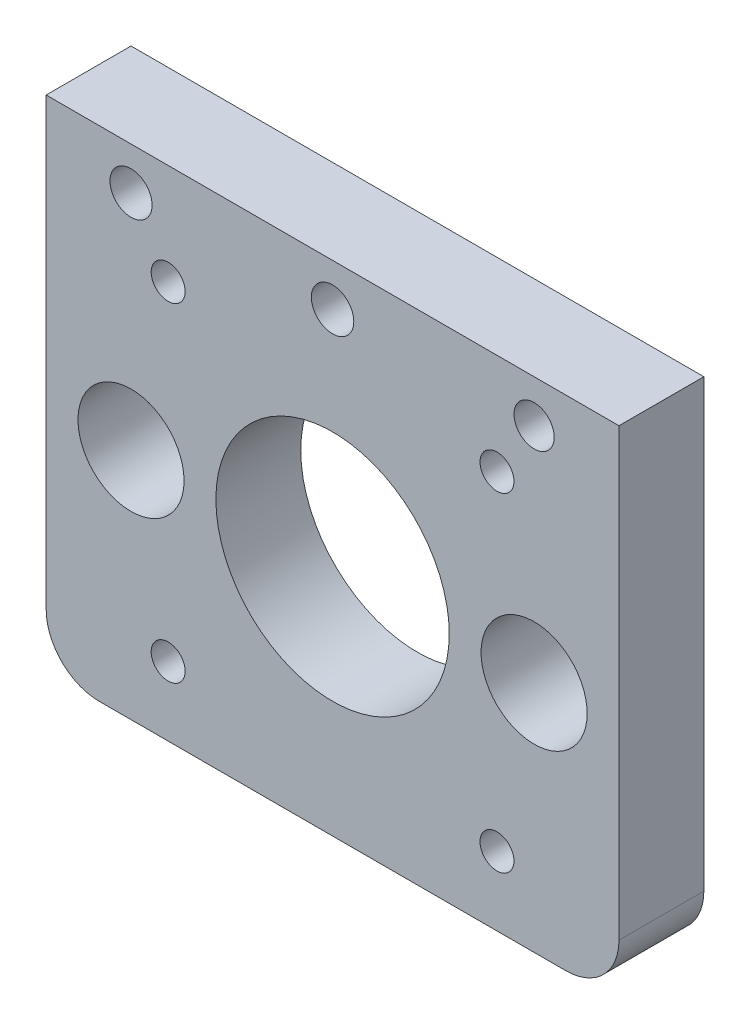
ISO-10303-21;
HEADER;
FILE_DESCRIPTION(('STEP AP214'),'2;1');
FILE_NAME('part.step','',(''),(''),'','','');
FILE_SCHEMA(('AUTOMOTIVE_DESIGN { 1 0 10303 214 1 1 1 1 }'));
ENDSEC;
DATA;
#1=APPLICATION_CONTEXT('core data for automotive mechanical design processes');
#2=APPLICATION_PROTOCOL_DEFINITION('international standard','automotive_design',2000,#1);
#3=PRODUCT_CONTEXT('',#1,'mechanical');
#4=PRODUCT('Part','Part','',(#3));
#5=PRODUCT_RELATED_PRODUCT_CATEGORY('part','',(#4));
#6=PRODUCT_DEFINITION_FORMATION('','',#4);
#7=PRODUCT_DEFINITION_CONTEXT('part definition',#1,'design');
#8=PRODUCT_DEFINITION('design','',#6,#7);
#9=PRODUCT_DEFINITION_SHAPE('','',#8);
#10=(LENGTH_UNIT() NAMED_UNIT(*) SI_UNIT(.MILLI.,.METRE.));
#11=(NAMED_UNIT(*) PLANE_ANGLE_UNIT() SI_UNIT($,.RADIAN.));
#12=(NAMED_UNIT(*) SI_UNIT($,.STERADIAN.) SOLID_ANGLE_UNIT());
#13=UNCERTAINTY_MEASURE_WITH_UNIT(LENGTH_MEASURE(1.E-05),#10,'distance_accuracy_value','');
#14=(GEOMETRIC_REPRESENTATION_CONTEXT(3) GLOBAL_UNCERTAINTY_ASSIGNED_CONTEXT((#13)) GLOBAL_UNIT_ASSIGNED_CONTEXT((#10,
#11,#12)) REPRESENTATION_CONTEXT('',''));
#15=CARTESIAN_POINT('',(0.,0.,0.));
#16=DIRECTION('',(0.,0.,1.));
#17=DIRECTION('',(1.,0.,0.));
#18=AXIS2_PLACEMENT_3D('',#15,#16,#17);
#19=CARTESIAN_POINT('',(-22.,-17.,8.));
#20=DIRECTION('',(0.,0.,-1.));
#21=DIRECTION('',(-1.,0.,0.));
#22=AXIS2_PLACEMENT_3D('',#19,#20,#21);
#23=PLANE('',#22);
#24=CARTESIAN_POINT('',(15.5,-15.5,8.));
#25=DIRECTION('',(0.,0.,1.));
#26=DIRECTION('',(1.,0.,0.));
#27=AXIS2_PLACEMENT_3D('',#24,#25,#26);
#28=CIRCLE('',#27,1.6);
#29=CARTESIAN_POINT('',(17.1,-15.5,8.));
#30=VERTEX_POINT('',#29);
#31=EDGE_CURVE('E213',#30,#30,#28,.T.);
#32=ORIENTED_EDGE('',*,*,#31,.F.);
#33=EDGE_LOOP('',(#32));
#34=FACE_BOUND('',#33,.T.);
#35=CARTESIAN_POINT('',(-15.5,15.5,8.));
#36=DIRECTION('',(0.,0.,1.));
#37=DIRECTION('',(1.,0.,0.));
#38=AXIS2_PLACEMENT_3D('',#35,#36,#37);
#39=CIRCLE('',#38,1.6);
#40=CARTESIAN_POINT('',(-13.9,15.5,8.));
#41=VERTEX_POINT('',#40);
#42=EDGE_CURVE('E225',#41,#41,#39,.T.);
#43=ORIENTED_EDGE('',*,*,#42,.F.);
#44=EDGE_LOOP('',(#43));
#45=FACE_BOUND('',#44,.T.);
#46=CARTESIAN_POINT('',(-19.,21.,8.));
#47=DIRECTION('',(0.,0.,1.));
#48=DIRECTION('',(1.,0.,0.));
#49=AXIS2_PLACEMENT_3D('',#46,#47,#48);
#50=CIRCLE('',#49,1.98463309671091);
#51=CARTESIAN_POINT('',(-17.0153669032891,21.,8.));
#52=VERTEX_POINT('',#51);
#53=EDGE_CURVE('E237',#52,#52,#50,.T.);
#54=ORIENTED_EDGE('',*,*,#53,.F.);
#55=EDGE_LOOP('',(#54));
#56=FACE_BOUND('',#55,.T.);
#57=CARTESIAN_POINT('',(0.,0.,8.));
#58=DIRECTION('',(0.,0.,1.));
#59=DIRECTION('',(1.,0.,0.));
#60=AXIS2_PLACEMENT_3D('',#57,#58,#59);
#61=CIRCLE('',#60,11.);
#62=CARTESIAN_POINT('',(11.,0.,8.));
#63=VERTEX_POINT('',#62);
#64=EDGE_CURVE('E249',#63,#63,#61,.T.);
#65=ORIENTED_EDGE('',*,*,#64,.F.);
#66=EDGE_LOOP('',(#65));
#67=FACE_BOUND('',#66,.T.);
#68=CARTESIAN_POINT('',(-19.,0.,8.));
#69=DIRECTION('',(0.,0.,1.));
#70=DIRECTION('',(1.,0.,0.));
#71=AXIS2_PLACEMENT_3D('',#68,#69,#70);
#72=CIRCLE('',#71,5.);
#73=CARTESIAN_POINT('',(-14.,0.,8.));
#74=VERTEX_POINT('',#73);
#75=EDGE_CURVE('E121',#74,#74,#72,.T.);
#76=ORIENTED_EDGE('',*,*,#75,.F.);
#77=EDGE_LOOP('',(#76));
#78=FACE_BOUND('',#77,.T.);
#79=DIRECTION('',(0.,1.,0.));
#80=VECTOR('',#79,1.);
#81=CARTESIAN_POINT('',(27.,-17.,8.));
#82=LINE('',#81,#80);
#83=CARTESIAN_POINT('',(27.,-17.,8.));
#84=VERTEX_POINT('',#83);
#85=CARTESIAN_POINT('',(27.,25.,8.));
#86=VERTEX_POINT('',#85);
#87=EDGE_CURVE('E128',#84,#86,#82,.T.);
#88=ORIENTED_EDGE('',*,*,#87,.T.);
#89=DIRECTION('',(-1.,0.,0.));
#90=VECTOR('',#89,1.);
#91=CARTESIAN_POINT('',(-27.,25.,8.));
#92=LINE('',#91,#90);
#93=CARTESIAN_POINT('',(-27.,25.,8.));
#94=VERTEX_POINT('',#93);
#95=EDGE_CURVE('E86',#86,#94,#92,.T.);
#96=ORIENTED_EDGE('',*,*,#95,.T.);
#97=DIRECTION('',(0.,-1.,0.));
#98=VECTOR('',#97,1.);
#99=CARTESIAN_POINT('',(-27.,-17.,8.));
#100=LINE('',#99,#98);
#101=CARTESIAN_POINT('',(-27.,-17.,8.));
#102=VERTEX_POINT('',#101);
#103=EDGE_CURVE('E99',#94,#102,#100,.T.);
#104=ORIENTED_EDGE('',*,*,#103,.T.);
#105=CARTESIAN_POINT('',(-22.,-17.,8.));
#106=DIRECTION('',(0.,0.,1.));
#107=DIRECTION('',(-1.,0.,0.));
#108=AXIS2_PLACEMENT_3D('',#105,#106,#107);
#109=CIRCLE('',#108,5.);
#110=CARTESIAN_POINT('',(-22.,-22.,8.));
#111=VERTEX_POINT('',#110);
#112=EDGE_CURVE('E93',#102,#111,#109,.T.);
#113=ORIENTED_EDGE('',*,*,#112,.T.);
#114=DIRECTION('',(1.,0.,0.));
#115=VECTOR('',#114,1.);
#116=CARTESIAN_POINT('',(-22.,-22.,8.));
#117=LINE('',#116,#115);
#118=CARTESIAN_POINT('',(22.,-22.,8.));
#119=VERTEX_POINT('',#118);
#120=EDGE_CURVE('E97',#111,#119,#117,.T.);
#121=ORIENTED_EDGE('',*,*,#120,.T.);
#122=CARTESIAN_POINT('',(22.,-17.,8.));
#123=DIRECTION('',(0.,0.,1.));
#124=DIRECTION('',(-1.,0.,0.));
#125=AXIS2_PLACEMENT_3D('',#122,#123,#124);
#126=CIRCLE('',#125,5.);
#127=EDGE_CURVE('E49',#119,#84,#126,.T.);
#128=ORIENTED_EDGE('',*,*,#127,.T.);
#129=EDGE_LOOP('',(#88,#96,#104,#113,#121,#128));
#130=FACE_BOUND('',#129,.T.);
#131=CARTESIAN_POINT('',(19.,0.,8.));
#132=DIRECTION('',(0.,0.,1.));
#133=DIRECTION('',(1.,0.,0.));
#134=AXIS2_PLACEMENT_3D('',#131,#132,#133);
#135=CIRCLE('',#134,5.);
#136=CARTESIAN_POINT('',(24.,0.,8.));
#137=VERTEX_POINT('',#136);
#138=EDGE_CURVE('E255',#137,#137,#135,.T.);
#139=ORIENTED_EDGE('',*,*,#138,.F.);
#140=EDGE_LOOP('',(#139));
#141=FACE_BOUND('',#140,.T.);
#142=CARTESIAN_POINT('',(0.,21.,8.));
#143=DIRECTION('',(0.,0.,1.));
#144=DIRECTION('',(1.,0.,0.));
#145=AXIS2_PLACEMENT_3D('',#142,#143,#144);
#146=CIRCLE('',#145,2.);
#147=CARTESIAN_POINT('',(2.,21.,8.));
#148=VERTEX_POINT('',#147);
#149=EDGE_CURVE('E243',#148,#148,#146,.T.);
#150=ORIENTED_EDGE('',*,*,#149,.F.);
#151=EDGE_LOOP('',(#150));
#152=FACE_BOUND('',#151,.T.);
#153=CARTESIAN_POINT('',(19.,21.,8.));
#154=DIRECTION('',(0.,0.,1.));
#155=DIRECTION('',(1.,0.,0.));
#156=AXIS2_PLACEMENT_3D('',#153,#154,#155);
#157=CIRCLE('',#156,1.89435690287992);
#158=CARTESIAN_POINT('',(20.8943569028799,21.,8.));
#159=VERTEX_POINT('',#158);
#160=EDGE_CURVE('E231',#159,#159,#157,.T.);
#161=ORIENTED_EDGE('',*,*,#160,.F.);
#162=EDGE_LOOP('',(#161));
#163=FACE_BOUND('',#162,.T.);
#164=CARTESIAN_POINT('',(15.5,15.5,8.));
#165=DIRECTION('',(0.,0.,1.));
#166=DIRECTION('',(1.,0.,0.));
#167=AXIS2_PLACEMENT_3D('',#164,#165,#166);
#168=CIRCLE('',#167,1.6);
#169=CARTESIAN_POINT('',(17.1,15.5,8.));
#170=VERTEX_POINT('',#169);
#171=EDGE_CURVE('E219',#170,#170,#168,.T.);
#172=ORIENTED_EDGE('',*,*,#171,.F.);
#173=EDGE_LOOP('',(#172));
#174=FACE_BOUND('',#173,.T.);
#175=CARTESIAN_POINT('',(-15.5,-15.5,8.));
#176=DIRECTION('',(0.,0.,1.));
#177=DIRECTION('',(1.,0.,0.));
#178=AXIS2_PLACEMENT_3D('',#175,#176,#177);
#179=CIRCLE('',#178,1.6);
#180=CARTESIAN_POINT('',(-13.9,-15.5,8.));
#181=VERTEX_POINT('',#180);
#182=EDGE_CURVE('E204',#181,#181,#179,.T.);
#183=ORIENTED_EDGE('',*,*,#182,.F.);
#184=EDGE_LOOP('',(#183));
#185=FACE_BOUND('',#184,.T.);
#186=ADVANCED_FACE('F32',(#34,#45,#56,#67,#78,#130,#141,#152,#163,#174,#185),#23,.F.);
#187=CARTESIAN_POINT('',(-22.,-17.,0.));
#188=DIRECTION('',(0.,0.,-1.));
#189=DIRECTION('',(-1.,0.,0.));
#190=AXIS2_PLACEMENT_3D('',#187,#188,#189);
#191=PLANE('',#190);
#192=CARTESIAN_POINT('',(15.5,-15.5,0.));
#193=DIRECTION('',(0.,0.,1.));
#194=DIRECTION('',(1.,0.,0.));
#195=AXIS2_PLACEMENT_3D('',#192,#193,#194);
#196=CIRCLE('',#195,1.6);
#197=CARTESIAN_POINT('',(17.1,-15.5,0.));
#198=VERTEX_POINT('',#197);
#199=EDGE_CURVE('E210',#198,#198,#196,.T.);
#200=ORIENTED_EDGE('',*,*,#199,.T.);
#201=EDGE_LOOP('',(#200));
#202=FACE_BOUND('',#201,.T.);
#203=CARTESIAN_POINT('',(-15.5,15.5,0.));
#204=DIRECTION('',(0.,0.,1.));
#205=DIRECTION('',(1.,0.,0.));
#206=AXIS2_PLACEMENT_3D('',#203,#204,#205);
#207=CIRCLE('',#206,1.6);
#208=CARTESIAN_POINT('',(-13.9,15.5,0.));
#209=VERTEX_POINT('',#208);
#210=EDGE_CURVE('E222',#209,#209,#207,.T.);
#211=ORIENTED_EDGE('',*,*,#210,.T.);
#212=EDGE_LOOP('',(#211));
#213=FACE_BOUND('',#212,.T.);
#214=CARTESIAN_POINT('',(-19.,21.,0.));
#215=DIRECTION('',(0.,0.,1.));
#216=DIRECTION('',(1.,0.,0.));
#217=AXIS2_PLACEMENT_3D('',#214,#215,#216);
#218=CIRCLE('',#217,1.98463309671091);
#219=CARTESIAN_POINT('',(-17.0153669032891,21.,0.));
#220=VERTEX_POINT('',#219);
#221=EDGE_CURVE('E234',#220,#220,#218,.T.);
#222=ORIENTED_EDGE('',*,*,#221,.T.);
#223=EDGE_LOOP('',(#222));
#224=FACE_BOUND('',#223,.T.);
#225=CARTESIAN_POINT('',(0.,0.,0.));
#226=DIRECTION('',(0.,0.,1.));
#227=DIRECTION('',(1.,0.,0.));
#228=AXIS2_PLACEMENT_3D('',#225,#226,#227);
#229=CIRCLE('',#228,11.);
#230=CARTESIAN_POINT('',(11.,0.,0.));
#231=VERTEX_POINT('',#230);
#232=EDGE_CURVE('E246',#231,#231,#229,.T.);
#233=ORIENTED_EDGE('',*,*,#232,.T.);
#234=EDGE_LOOP('',(#233));
#235=FACE_BOUND('',#234,.T.);
#236=CARTESIAN_POINT('',(-19.,0.,0.));
#237=DIRECTION('',(0.,0.,1.));
#238=DIRECTION('',(1.,0.,0.));
#239=AXIS2_PLACEMENT_3D('',#236,#237,#238);
#240=CIRCLE('',#239,5.);
#241=CARTESIAN_POINT('',(-14.,0.,0.));
#242=VERTEX_POINT('',#241);
#243=EDGE_CURVE('E258',#242,#242,#240,.T.);
#244=ORIENTED_EDGE('',*,*,#243,.T.);
#245=EDGE_LOOP('',(#244));
#246=FACE_BOUND('',#245,.T.);
#247=DIRECTION('',(0.,1.,0.));
#248=VECTOR('',#247,1.);
#249=CARTESIAN_POINT('',(27.,-17.,0.));
#250=LINE('',#249,#248);
#251=CARTESIAN_POINT('',(27.,-17.,0.));
#252=VERTEX_POINT('',#251);
#253=CARTESIAN_POINT('',(27.,25.,0.));
#254=VERTEX_POINT('',#253);
#255=EDGE_CURVE('E117',#252,#254,#250,.T.);
#256=ORIENTED_EDGE('',*,*,#255,.F.);
#257=CARTESIAN_POINT('',(22.,-17.,0.));
#258=DIRECTION('',(0.,0.,1.));
#259=DIRECTION('',(-1.,0.,0.));
#260=AXIS2_PLACEMENT_3D('',#257,#258,#259);
#261=CIRCLE('',#260,5.);
#262=CARTESIAN_POINT('',(22.,-22.,0.));
#263=VERTEX_POINT('',#262);
#264=EDGE_CURVE('E78',#263,#252,#261,.T.);
#265=ORIENTED_EDGE('',*,*,#264,.F.);
#266=DIRECTION('',(1.,0.,0.));
#267=VECTOR('',#266,1.);
#268=CARTESIAN_POINT('',(-22.,-22.,0.));
#269=LINE('',#268,#267);
#270=CARTESIAN_POINT('',(-22.,-22.,0.));
#271=VERTEX_POINT('',#270);
#272=EDGE_CURVE('E72',#271,#263,#269,.T.);
#273=ORIENTED_EDGE('',*,*,#272,.F.);
#274=CARTESIAN_POINT('',(-22.,-17.,0.));
#275=DIRECTION('',(0.,0.,1.));
#276=DIRECTION('',(-1.,0.,0.));
#277=AXIS2_PLACEMENT_3D('',#274,#275,#276);
#278=CIRCLE('',#277,5.);
#279=CARTESIAN_POINT('',(-27.,-17.,0.));
#280=VERTEX_POINT('',#279);
#281=EDGE_CURVE('E107',#280,#271,#278,.T.);
#282=ORIENTED_EDGE('',*,*,#281,.F.);
#283=DIRECTION('',(0.,-1.,0.));
#284=VECTOR('',#283,1.);
#285=CARTESIAN_POINT('',(-27.,-17.,0.));
#286=LINE('',#285,#284);
#287=CARTESIAN_POINT('',(-27.,25.,0.));
#288=VERTEX_POINT('',#287);
#289=EDGE_CURVE('E123',#288,#280,#286,.T.);
#290=ORIENTED_EDGE('',*,*,#289,.F.);
#291=DIRECTION('',(-1.,0.,0.));
#292=VECTOR('',#291,1.);
#293=CARTESIAN_POINT('',(-27.,25.,0.));
#294=LINE('',#293,#292);
#295=EDGE_CURVE('E120',#254,#288,#294,.T.);
#296=ORIENTED_EDGE('',*,*,#295,.F.);
#297=EDGE_LOOP('',(#256,#265,#273,#282,#290,#296));
#298=FACE_BOUND('',#297,.T.);
#299=CARTESIAN_POINT('',(19.,0.,0.));
#300=DIRECTION('',(0.,0.,1.));
#301=DIRECTION('',(1.,0.,0.));
#302=AXIS2_PLACEMENT_3D('',#299,#300,#301);
#303=CIRCLE('',#302,5.);
#304=CARTESIAN_POINT('',(24.,0.,0.));
#305=VERTEX_POINT('',#304);
#306=EDGE_CURVE('E252',#305,#305,#303,.T.);
#307=ORIENTED_EDGE('',*,*,#306,.T.);
#308=EDGE_LOOP('',(#307));
#309=FACE_BOUND('',#308,.T.);
#310=CARTESIAN_POINT('',(0.,21.,0.));
#311=DIRECTION('',(0.,0.,1.));
#312=DIRECTION('',(1.,0.,0.));
#313=AXIS2_PLACEMENT_3D('',#310,#311,#312);
#314=CIRCLE('',#313,2.);
#315=CARTESIAN_POINT('',(2.,21.,0.));
#316=VERTEX_POINT('',#315);
#317=EDGE_CURVE('E240',#316,#316,#314,.T.);
#318=ORIENTED_EDGE('',*,*,#317,.T.);
#319=EDGE_LOOP('',(#318));
#320=FACE_BOUND('',#319,.T.);
#321=CARTESIAN_POINT('',(19.,21.,0.));
#322=DIRECTION('',(0.,0.,1.));
#323=DIRECTION('',(1.,0.,0.));
#324=AXIS2_PLACEMENT_3D('',#321,#322,#323);
#325=CIRCLE('',#324,1.89435690287992);
#326=CARTESIAN_POINT('',(20.8943569028799,21.,0.));
#327=VERTEX_POINT('',#326);
#328=EDGE_CURVE('E228',#327,#327,#325,.T.);
#329=ORIENTED_EDGE('',*,*,#328,.T.);
#330=EDGE_LOOP('',(#329));
#331=FACE_BOUND('',#330,.T.);
#332=CARTESIAN_POINT('',(15.5,15.5,0.));
#333=DIRECTION('',(0.,0.,1.));
#334=DIRECTION('',(1.,0.,0.));
#335=AXIS2_PLACEMENT_3D('',#332,#333,#334);
#336=CIRCLE('',#335,1.6);
#337=CARTESIAN_POINT('',(17.1,15.5,0.));
#338=VERTEX_POINT('',#337);
#339=EDGE_CURVE('E216',#338,#338,#336,.T.);
#340=ORIENTED_EDGE('',*,*,#339,.T.);
#341=EDGE_LOOP('',(#340));
#342=FACE_BOUND('',#341,.T.);
#343=CARTESIAN_POINT('',(-15.5,-15.5,0.));
#344=DIRECTION('',(0.,0.,1.));
#345=DIRECTION('',(1.,0.,0.));
#346=AXIS2_PLACEMENT_3D('',#343,#344,#345);
#347=CIRCLE('',#346,1.6);
#348=CARTESIAN_POINT('',(-13.9,-15.5,0.));
#349=VERTEX_POINT('',#348);
#350=EDGE_CURVE('E207',#349,#349,#347,.T.);
#351=ORIENTED_EDGE('',*,*,#350,.T.);
#352=EDGE_LOOP('',(#351));
#353=FACE_BOUND('',#352,.T.);
#354=ADVANCED_FACE('F137',(#202,#213,#224,#235,#246,#298,#309,#320,#331,#342,#353),#191,.T.);
#355=CARTESIAN_POINT('',(27.,-17.,8.));
#356=DIRECTION('',(-1.,0.,0.));
#357=DIRECTION('',(0.,0.,1.));
#358=AXIS2_PLACEMENT_3D('',#355,#356,#357);
#359=PLANE('',#358);
#360=ORIENTED_EDGE('',*,*,#255,.T.);
#361=DIRECTION('',(0.,0.,-1.));
#362=VECTOR('',#361,1.);
#363=CARTESIAN_POINT('',(27.,25.,8.));
#364=LINE('',#363,#362);
#365=EDGE_CURVE('E11',#86,#254,#364,.T.);
#366=ORIENTED_EDGE('',*,*,#365,.F.);
#367=ORIENTED_EDGE('',*,*,#87,.F.);
#368=DIRECTION('',(0.,0.,-1.));
#369=VECTOR('',#368,1.);
#370=CARTESIAN_POINT('',(27.,-17.,8.));
#371=LINE('',#370,#369);
#372=EDGE_CURVE('E113',#84,#252,#371,.T.);
#373=ORIENTED_EDGE('',*,*,#372,.T.);
#374=EDGE_LOOP('',(#360,#366,#367,#373));
#375=FACE_BOUND('',#374,.T.);
#376=ADVANCED_FACE('F34',(#375),#359,.F.);
#377=CARTESIAN_POINT('',(-27.,25.,8.));
#378=DIRECTION('',(0.,-1.,0.));
#379=DIRECTION('',(0.,0.,-1.));
#380=AXIS2_PLACEMENT_3D('',#377,#378,#379);
#381=PLANE('',#380);
#382=ORIENTED_EDGE('',*,*,#295,.T.);
#383=DIRECTION('',(0.,0.,-1.));
#384=VECTOR('',#383,1.);
#385=CARTESIAN_POINT('',(-27.,25.,8.));
#386=LINE('',#385,#384);
#387=EDGE_CURVE('E41',#94,#288,#386,.T.);
#388=ORIENTED_EDGE('',*,*,#387,.F.);
#389=ORIENTED_EDGE('',*,*,#95,.F.);
#390=ORIENTED_EDGE('',*,*,#365,.T.);
#391=EDGE_LOOP('',(#382,#388,#389,#390));
#392=FACE_BOUND('',#391,.T.);
#393=ADVANCED_FACE('F369',(#392),#381,.F.);
#394=CARTESIAN_POINT('',(-27.,-17.,8.));
#395=DIRECTION('',(1.,0.,0.));
#396=DIRECTION('',(0.,0.,-1.));
#397=AXIS2_PLACEMENT_3D('',#394,#395,#396);
#398=PLANE('',#397);
#399=ORIENTED_EDGE('',*,*,#289,.T.);
#400=DIRECTION('',(0.,0.,-1.));
#401=VECTOR('',#400,1.);
#402=CARTESIAN_POINT('',(-27.,-17.,8.));
#403=LINE('',#402,#401);
#404=EDGE_CURVE('E108',#102,#280,#403,.T.);
#405=ORIENTED_EDGE('',*,*,#404,.F.);
#406=ORIENTED_EDGE('',*,*,#103,.F.);
#407=ORIENTED_EDGE('',*,*,#387,.T.);
#408=EDGE_LOOP('',(#399,#405,#406,#407));
#409=FACE_BOUND('',#408,.T.);
#410=ADVANCED_FACE('F134',(#409),#398,.F.);
#411=CARTESIAN_POINT('',(-22.,-17.,8.));
#412=DIRECTION('',(0.,0.,-1.));
#413=DIRECTION('',(-1.,0.,0.));
#414=AXIS2_PLACEMENT_3D('',#411,#412,#413);
#415=CYLINDRICAL_SURFACE('',#414,5.);
#416=ORIENTED_EDGE('',*,*,#281,.T.);
#417=DIRECTION('',(0.,0.,-1.));
#418=VECTOR('',#417,1.);
#419=CARTESIAN_POINT('',(-22.,-22.,8.));
#420=LINE('',#419,#418);
#421=EDGE_CURVE('E104',#111,#271,#420,.T.);
#422=ORIENTED_EDGE('',*,*,#421,.F.);
#423=ORIENTED_EDGE('',*,*,#112,.F.);
#424=ORIENTED_EDGE('',*,*,#404,.T.);
#425=EDGE_LOOP('',(#416,#422,#423,#424));
#426=FACE_BOUND('',#425,.T.);
#427=ADVANCED_FACE('F105',(#426),#415,.T.);
#428=CARTESIAN_POINT('',(-22.,-22.,8.));
#429=DIRECTION('',(0.,1.,0.));
#430=DIRECTION('',(0.,0.,1.));
#431=AXIS2_PLACEMENT_3D('',#428,#429,#430);
#432=PLANE('',#431);
#433=ORIENTED_EDGE('',*,*,#272,.T.);
#434=DIRECTION('',(0.,0.,-1.));
#435=VECTOR('',#434,1.);
#436=CARTESIAN_POINT('',(22.,-22.,8.));
#437=LINE('',#436,#435);
#438=EDGE_CURVE('E109',#119,#263,#437,.T.);
#439=ORIENTED_EDGE('',*,*,#438,.F.);
#440=ORIENTED_EDGE('',*,*,#120,.F.);
#441=ORIENTED_EDGE('',*,*,#421,.T.);
#442=EDGE_LOOP('',(#433,#439,#440,#441));
#443=FACE_BOUND('',#442,.T.);
#444=ADVANCED_FACE('F111',(#443),#432,.F.);
#445=CARTESIAN_POINT('',(22.,-17.,8.));
#446=DIRECTION('',(0.,0.,-1.));
#447=DIRECTION('',(-1.,0.,0.));
#448=AXIS2_PLACEMENT_3D('',#445,#446,#447);
#449=CYLINDRICAL_SURFACE('',#448,5.);
#450=ORIENTED_EDGE('',*,*,#264,.T.);
#451=ORIENTED_EDGE('',*,*,#372,.F.);
#452=ORIENTED_EDGE('',*,*,#127,.F.);
#453=ORIENTED_EDGE('',*,*,#438,.T.);
#454=EDGE_LOOP('',(#450,#451,#452,#453));
#455=FACE_BOUND('',#454,.T.);
#456=ADVANCED_FACE('F142',(#455),#449,.T.);
#457=CARTESIAN_POINT('',(-19.,0.,8.));
#458=DIRECTION('',(0.,0.,-1.));
#459=DIRECTION('',(-1.,0.,0.));
#460=AXIS2_PLACEMENT_3D('',#457,#458,#459);
#461=CYLINDRICAL_SURFACE('',#460,5.);
#462=ORIENTED_EDGE('',*,*,#75,.T.);
#463=EDGE_LOOP('',(#462));
#464=FACE_BOUND('',#463,.T.);
#465=ORIENTED_EDGE('',*,*,#243,.F.);
#466=EDGE_LOOP('',(#465));
#467=FACE_BOUND('',#466,.T.);
#468=ADVANCED_FACE('F144',(#464,#467),#461,.F.);
#469=CARTESIAN_POINT('',(19.,0.,8.));
#470=DIRECTION('',(0.,0.,-1.));
#471=DIRECTION('',(-1.,0.,0.));
#472=AXIS2_PLACEMENT_3D('',#469,#470,#471);
#473=CYLINDRICAL_SURFACE('',#472,5.);
#474=ORIENTED_EDGE('',*,*,#138,.T.);
#475=EDGE_LOOP('',(#474));
#476=FACE_BOUND('',#475,.T.);
#477=ORIENTED_EDGE('',*,*,#306,.F.);
#478=EDGE_LOOP('',(#477));
#479=FACE_BOUND('',#478,.T.);
#480=ADVANCED_FACE('F150',(#476,#479),#473,.F.);
#481=CARTESIAN_POINT('',(0.,0.,8.));
#482=DIRECTION('',(0.,0.,-1.));
#483=DIRECTION('',(-1.,0.,0.));
#484=AXIS2_PLACEMENT_3D('',#481,#482,#483);
#485=CYLINDRICAL_SURFACE('',#484,11.);
#486=ORIENTED_EDGE('',*,*,#64,.T.);
#487=EDGE_LOOP('',(#486));
#488=FACE_BOUND('',#487,.T.);
#489=ORIENTED_EDGE('',*,*,#232,.F.);
#490=EDGE_LOOP('',(#489));
#491=FACE_BOUND('',#490,.T.);
#492=ADVANCED_FACE('F167',(#488,#491),#485,.F.);
#493=CARTESIAN_POINT('',(0.,21.,8.));
#494=DIRECTION('',(0.,0.,-1.));
#495=DIRECTION('',(-1.,0.,0.));
#496=AXIS2_PLACEMENT_3D('',#493,#494,#495);
#497=CYLINDRICAL_SURFACE('',#496,2.);
#498=ORIENTED_EDGE('',*,*,#149,.T.);
#499=EDGE_LOOP('',(#498));
#500=FACE_BOUND('',#499,.T.);
#501=ORIENTED_EDGE('',*,*,#317,.F.);
#502=EDGE_LOOP('',(#501));
#503=FACE_BOUND('',#502,.T.);
#504=ADVANCED_FACE('F171',(#500,#503),#497,.F.);
#505=CARTESIAN_POINT('',(-19.,21.,8.));
#506=DIRECTION('',(0.,0.,-1.));
#507=DIRECTION('',(-1.,0.,0.));
#508=AXIS2_PLACEMENT_3D('',#505,#506,#507);
#509=CYLINDRICAL_SURFACE('',#508,1.98463309671091);
#510=ORIENTED_EDGE('',*,*,#53,.T.);
#511=EDGE_LOOP('',(#510));
#512=FACE_BOUND('',#511,.T.);
#513=ORIENTED_EDGE('',*,*,#221,.F.);
#514=EDGE_LOOP('',(#513));
#515=FACE_BOUND('',#514,.T.);
#516=ADVANCED_FACE('F175',(#512,#515),#509,.F.);
#517=CARTESIAN_POINT('',(19.,21.,8.));
#518=DIRECTION('',(0.,0.,-1.));
#519=DIRECTION('',(-1.,0.,0.));
#520=AXIS2_PLACEMENT_3D('',#517,#518,#519);
#521=CYLINDRICAL_SURFACE('',#520,1.89435690287992);
#522=ORIENTED_EDGE('',*,*,#160,.T.);
#523=EDGE_LOOP('',(#522));
#524=FACE_BOUND('',#523,.T.);
#525=ORIENTED_EDGE('',*,*,#328,.F.);
#526=EDGE_LOOP('',(#525));
#527=FACE_BOUND('',#526,.T.);
#528=ADVANCED_FACE('F179',(#524,#527),#521,.F.);
#529=CARTESIAN_POINT('',(-15.5,15.5,8.));
#530=DIRECTION('',(0.,0.,-1.));
#531=DIRECTION('',(-1.,0.,0.));
#532=AXIS2_PLACEMENT_3D('',#529,#530,#531);
#533=CYLINDRICAL_SURFACE('',#532,1.6);
#534=ORIENTED_EDGE('',*,*,#42,.T.);
#535=EDGE_LOOP('',(#534));
#536=FACE_BOUND('',#535,.T.);
#537=ORIENTED_EDGE('',*,*,#210,.F.);
#538=EDGE_LOOP('',(#537));
#539=FACE_BOUND('',#538,.T.);
#540=ADVANCED_FACE('F183',(#536,#539),#533,.F.);
#541=CARTESIAN_POINT('',(15.5,15.5,8.));
#542=DIRECTION('',(0.,0.,-1.));
#543=DIRECTION('',(-1.,0.,0.));
#544=AXIS2_PLACEMENT_3D('',#541,#542,#543);
#545=CYLINDRICAL_SURFACE('',#544,1.6);
#546=ORIENTED_EDGE('',*,*,#171,.T.);
#547=EDGE_LOOP('',(#546));
#548=FACE_BOUND('',#547,.T.);
#549=ORIENTED_EDGE('',*,*,#339,.F.);
#550=EDGE_LOOP('',(#549));
#551=FACE_BOUND('',#550,.T.);
#552=ADVANCED_FACE('F187',(#548,#551),#545,.F.);
#553=CARTESIAN_POINT('',(15.5,-15.5,8.));
#554=DIRECTION('',(0.,0.,-1.));
#555=DIRECTION('',(-1.,0.,0.));
#556=AXIS2_PLACEMENT_3D('',#553,#554,#555);
#557=CYLINDRICAL_SURFACE('',#556,1.6);
#558=ORIENTED_EDGE('',*,*,#31,.T.);
#559=EDGE_LOOP('',(#558));
#560=FACE_BOUND('',#559,.T.);
#561=ORIENTED_EDGE('',*,*,#199,.F.);
#562=EDGE_LOOP('',(#561));
#563=FACE_BOUND('',#562,.T.);
#564=ADVANCED_FACE('F191',(#560,#563),#557,.F.);
#565=CARTESIAN_POINT('',(-15.5,-15.5,8.));
#566=DIRECTION('',(0.,0.,-1.));
#567=DIRECTION('',(-1.,0.,0.));
#568=AXIS2_PLACEMENT_3D('',#565,#566,#567);
#569=CYLINDRICAL_SURFACE('',#568,1.6);
#570=ORIENTED_EDGE('',*,*,#182,.T.);
#571=EDGE_LOOP('',(#570));
#572=FACE_BOUND('',#571,.T.);
#573=ORIENTED_EDGE('',*,*,#350,.F.);
#574=EDGE_LOOP('',(#573));
#575=FACE_BOUND('',#574,.T.);
#576=ADVANCED_FACE('F195',(#572,#575),#569,.F.);
#577=CLOSED_SHELL('',(#186,#354,#376,#393,#410,#427,#444,#456,#468,#480,#492,#504,#516,#528,
#540,#552,#564,#576));
#578=MANIFOLD_SOLID_BREP('B2',#577);
#579=ADVANCED_BREP_SHAPE_REPRESENTATION('',(#18,#578),#14);
#580=SHAPE_DEFINITION_REPRESENTATION(#9,#579);
ENDSEC;
END-ISO-10303-21;
